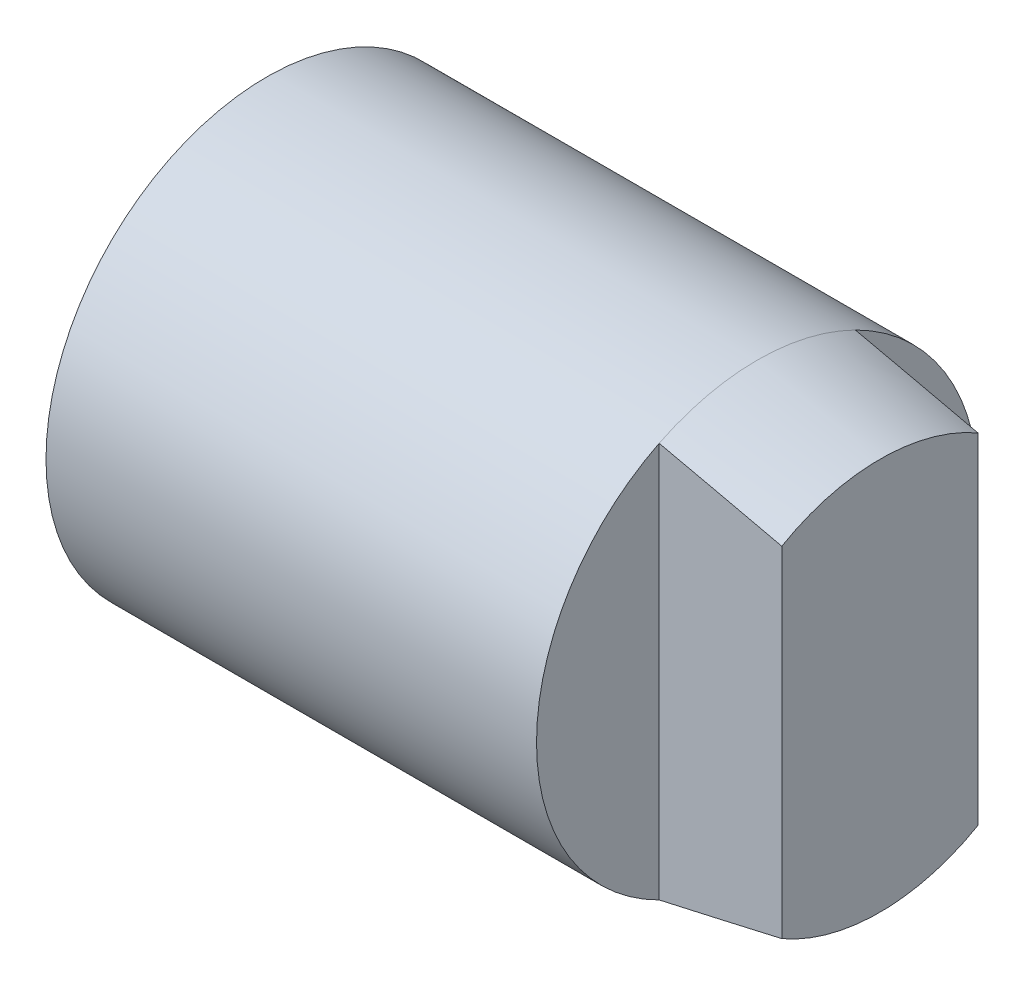
ISO-10303-21;
HEADER;
FILE_DESCRIPTION(('STEP AP214'),'2;1');
FILE_NAME('part.step','',(''),(''),'','','');
FILE_SCHEMA(('AUTOMOTIVE_DESIGN { 1 0 10303 214 1 1 1 1 }'));
ENDSEC;
DATA;
#1=APPLICATION_CONTEXT('core data for automotive mechanical design processes');
#2=APPLICATION_PROTOCOL_DEFINITION('international standard','automotive_design',2000,#1);
#3=PRODUCT_CONTEXT('',#1,'mechanical');
#4=PRODUCT('Part','Part','',(#3));
#5=PRODUCT_RELATED_PRODUCT_CATEGORY('part','',(#4));
#6=PRODUCT_DEFINITION_FORMATION('','',#4);
#7=PRODUCT_DEFINITION_CONTEXT('part definition',#1,'design');
#8=PRODUCT_DEFINITION('design','',#6,#7);
#9=PRODUCT_DEFINITION_SHAPE('','',#8);
#10=(LENGTH_UNIT() NAMED_UNIT(*) SI_UNIT(.MILLI.,.METRE.));
#11=(NAMED_UNIT(*) PLANE_ANGLE_UNIT() SI_UNIT($,.RADIAN.));
#12=(NAMED_UNIT(*) SI_UNIT($,.STERADIAN.) SOLID_ANGLE_UNIT());
#13=UNCERTAINTY_MEASURE_WITH_UNIT(LENGTH_MEASURE(1.E-05),#10,'distance_accuracy_value','');
#14=(GEOMETRIC_REPRESENTATION_CONTEXT(3) GLOBAL_UNCERTAINTY_ASSIGNED_CONTEXT((#13)) GLOBAL_UNIT_ASSIGNED_CONTEXT((#10,
#11,#12)) REPRESENTATION_CONTEXT('',''));
#15=CARTESIAN_POINT('',(0.,0.,0.));
#16=DIRECTION('',(0.,0.,1.));
#17=DIRECTION('',(1.,0.,0.));
#18=AXIS2_PLACEMENT_3D('',#15,#16,#17);
#19=CARTESIAN_POINT('',(12.5,0.,0.));
#20=DIRECTION('',(-1.,0.,0.));
#21=DIRECTION('',(0.,0.,1.));
#22=AXIS2_PLACEMENT_3D('',#19,#20,#21);
#23=CONICAL_SURFACE('',#22,4.,0.197395559849881);
#24=CARTESIAN_POINT('',(12.5,0.,0.));
#25=DIRECTION('',(-1.,0.,0.));
#26=DIRECTION('',(0.,0.,1.));
#27=AXIS2_PLACEMENT_3D('',#24,#25,#26);
#28=CIRCLE('',#27,4.);
#29=CARTESIAN_POINT('',(12.5,-3.46410161513775,-2.));
#30=VERTEX_POINT('',#29);
#31=CARTESIAN_POINT('',(12.5,-3.46410161513775,2.));
#32=VERTEX_POINT('',#31);
#33=EDGE_CURVE('E106',#30,#32,#28,.T.);
#34=ORIENTED_EDGE('',*,*,#33,.T.);
#35=CARTESIAN_POINT('',(20.9411715080671,-1.15942254775247,2.));
#36=CARTESIAN_POINT('',(20.8660016724411,-1.18938638592322,2.));
#37=CARTESIAN_POINT('',(20.790546172661,-1.21862022618851,2.));
#38=CARTESIAN_POINT('',(20.6391697872945,-1.27583995530349,2.));
#39=CARTESIAN_POINT('',(20.5632489400089,-1.30382594533054,2.));
#40=CARTESIAN_POINT('',(20.3349716714176,-1.38622180196954,2.));
#41=CARTESIAN_POINT('',(20.1820581365704,-1.43908616508855,2.));
#42=CARTESIAN_POINT('',(19.8753352179094,-1.5417434276278,2.));
#43=CARTESIAN_POINT('',(19.7215265573275,-1.59153850827934,2.));
#44=CARTESIAN_POINT('',(19.4131611090728,-1.68879307307252,2.));
#45=CARTESIAN_POINT('',(19.258604260008,-1.73625236185878,2.));
#46=CARTESIAN_POINT('',(18.7943481885781,-1.87580705564526,2.));
#47=CARTESIAN_POINT('',(18.4838252693263,-1.96515707542199,2.));
#48=CARTESIAN_POINT('',(17.8613557841292,-2.1389805851424,2.));
#49=CARTESIAN_POINT('',(17.5494089037841,-2.22345293574132,2.));
#50=CARTESIAN_POINT('',(16.9136687754089,-2.39175546676185,2.));
#51=CARTESIAN_POINT('',(16.5898423861397,-2.47546012179894,2.));
#52=CARTESIAN_POINT('',(15.941476384565,-2.64006628687885,2.));
#53=CARTESIAN_POINT('',(15.6169367628356,-2.72096775964292,2.));
#54=CARTESIAN_POINT('',(14.9673147337329,-2.88061681991976,2.));
#55=CARTESIAN_POINT('',(14.6422323040677,-2.95936431654369,2.));
#56=CARTESIAN_POINT('',(13.9916583109131,-3.1151526579043,2.));
#57=CARTESIAN_POINT('',(13.666166745898,-3.19219349625689,2.));
#58=CARTESIAN_POINT('',(12.6891675764667,-3.42128042925369,2.));
#59=CARTESIAN_POINT('',(12.0371803474347,-3.57128002828283,2.));
#60=CARTESIAN_POINT('',(10.7323843182456,-3.86756307761905,2.));
#61=CARTESIAN_POINT('',(10.0795755402218,-4.01384662588173,2.));
#62=CARTESIAN_POINT('',(8.77156604727338,-4.30412700552264,2.));
#63=CARTESIAN_POINT('',(8.11636369259255,-4.44811643905647,2.));
#64=CARTESIAN_POINT('',(6.80551386406938,-4.73408013404253,2.));
#65=CARTESIAN_POINT('',(6.14986638625635,-4.87605437726412,2.));
#66=CARTESIAN_POINT('',(4.83846400668146,-5.15840715007355,2.));
#67=CARTESIAN_POINT('',(4.18270921924132,-5.29878621119898,2.));
#68=CARTESIAN_POINT('',(2.87094480579042,-5.57830717351688,2.));
#69=CARTESIAN_POINT('',(2.21493518319291,-5.71744909072119,2.));
#70=CARTESIAN_POINT('',(1.55882849193293,-5.85612873591973,2.));
#71=B_SPLINE_CURVE_WITH_KNOTS('',3,(#35,#36,#37,#38,#39,#40,#41,#42,#43,#44,#45,#46,#47,#48,#49,
#50,#51,#52,#53,#54,#55,#56,#57,#58,#59,#60,#61,#62,#63,#64,#65,#66,#67,#68,#69,#70),
.UNSPECIFIED.,.F.,.F.,(4,2,2,2,2,2,2,2,2,2,2,2,2,2,2,2,2,4),(0.,0.242754141340651,
0.485488563925896,0.97082088746416,1.45580422826551,1.94082806225477,2.91012429587326,
3.87964603309553,4.88303749845384,5.88644230252268,6.88988938099956,7.89334021244289,
9.90038034572051,11.9073675181258,13.9198759201632,15.9324025169733,17.9442375935212,
19.9560465937038),.UNSPECIFIED.);
#72=CARTESIAN_POINT('',(10.,-4.03112887414928,2.));
#73=VERTEX_POINT('',#72);
#74=EDGE_CURVE('E11',#32,#73,#71,.T.);
#75=ORIENTED_EDGE('',*,*,#74,.T.);
#76=CARTESIAN_POINT('',(10.,0.,0.));
#77=DIRECTION('',(-1.,0.,0.));
#78=DIRECTION('',(0.,0.,1.));
#79=AXIS2_PLACEMENT_3D('',#76,#77,#78);
#80=CIRCLE('',#79,4.5);
#81=CARTESIAN_POINT('',(10.,-4.03112887414928,-2.));
#82=VERTEX_POINT('',#81);
#83=EDGE_CURVE('E98',#82,#73,#80,.T.);
#84=ORIENTED_EDGE('',*,*,#83,.F.);
#85=CARTESIAN_POINT('',(1.55882849193293,-5.85612873591973,-2.));
#86=CARTESIAN_POINT('',(1.98081306098831,-5.76694426998963,-2.));
#87=CARTESIAN_POINT('',(2.40275516963324,-5.6775590309681,-2.));
#88=CARTESIAN_POINT('',(3.24653998410319,-5.49831885983609,-2.));
#89=CARTESIAN_POINT('',(3.6683826898412,-5.4084639273161,-2.));
#90=CARTESIAN_POINT('',(4.93364106439664,-5.13811350229078,-2.));
#91=CARTESIAN_POINT('',(5.77688485514883,-4.95681173210658,-2.));
#92=CARTESIAN_POINT('',(7.46220174298452,-4.59136538446255,-2.));
#93=CARTESIAN_POINT('',(8.30427524277354,-4.4072226657726,-2.));
#94=CARTESIAN_POINT('',(9.98759255710945,-4.03469563290561,-2.));
#95=CARTESIAN_POINT('',(10.8288362620095,-3.84631082070706,-2.));
#96=CARTESIAN_POINT('',(12.0594442305662,-3.56573208510107,-2.));
#97=CARTESIAN_POINT('',(12.4493895583219,-3.47608803083638,-2.));
#98=CARTESIAN_POINT('',(13.2288601297159,-3.29502723295478,-2.));
#99=CARTESIAN_POINT('',(13.6183853825141,-3.20361052885197,-2.));
#100=CARTESIAN_POINT('',(14.3967827845945,-3.01853632162998,-2.));
#101=CARTESIAN_POINT('',(14.7856550924373,-2.92487948638373,-2.));
#102=CARTESIAN_POINT('',(15.562704196661,-2.73457703883739,-2.));
#103=CARTESIAN_POINT('',(15.9508809353758,-2.63793118985499,-2.));
#104=CARTESIAN_POINT('',(16.5325555109361,-2.48983872490716,-2.));
#105=CARTESIAN_POINT('',(16.7264444857504,-2.43992846298565,-2.));
#106=CARTESIAN_POINT('',(17.1138993661821,-2.33887545134378,-2.));
#107=CARTESIAN_POINT('',(17.3074652752797,-2.28773271499295,-2.));
#108=CARTESIAN_POINT('',(17.6941543191043,-2.18396864784065,-2.));
#109=CARTESIAN_POINT('',(17.8872775438381,-2.13134765308022,-2.));
#110=CARTESIAN_POINT('',(18.2730235396501,-2.02426654339214,-2.));
#111=CARTESIAN_POINT('',(18.465646289998,-1.96980635355019,-2.));
#112=CARTESIAN_POINT('',(18.8504313204654,-1.85850689930447,-2.));
#113=CARTESIAN_POINT('',(19.0425928747724,-1.80166511915304,-2.));
#114=CARTESIAN_POINT('',(19.4259848457997,-1.68497434093597,-2.));
#115=CARTESIAN_POINT('',(19.6172153646087,-1.62512568111184,-2.));
#116=CARTESIAN_POINT('',(19.9031411850902,-1.53226129828794,-2.));
#117=CARTESIAN_POINT('',(19.998334149301,-1.50077813225522,-2.));
#118=CARTESIAN_POINT('',(20.1883035139065,-1.43658769830577,-2.));
#119=CARTESIAN_POINT('',(20.2830799292905,-1.40388047484599,-2.));
#120=CARTESIAN_POINT('',(20.4721519957212,-1.3369863889372,-2.));
#121=CARTESIAN_POINT('',(20.5664474537764,-1.30279897786615,-2.));
#122=CARTESIAN_POINT('',(20.7543623680099,-1.23258302395656,-2.));
#123=CARTESIAN_POINT('',(20.8479817383567,-1.19655425188311,-2.));
#124=CARTESIAN_POINT('',(20.9411715080671,-1.15942254775247,-2.));
#125=B_SPLINE_CURVE_WITH_KNOTS('',3,(#85,#86,#87,#88,#89,#90,#91,#92,#93,#94,#95,#96,#97,#98,
#99,#100,#101,#102,#103,#104,#105,#106,#107,#108,#109,#110,#111,#112,#113,#114,#115,#116,#117,
#118,#119,#120,#121,#122,#123,#124),.UNSPECIFIED.,.F.,.F.,(4,2,2,2,2,2,2,2,2,2,2,2,2,2,2,2,2,2,
2,4),(0.,1.29391778443653,2.5878366971747,5.17537446468834,7.76128558629634,10.3475018930091,
11.5478491260678,12.7481696329053,13.9481366301643,15.1481988902183,15.7488252031734,
16.3494450036309,16.9499293573714,17.5504381996725,18.1515982125685,18.7526907522035,
19.0534764172858,19.3542511686148,19.6551383708441,19.956063122833),.UNSPECIFIED.);
#126=EDGE_CURVE('E124',#82,#30,#125,.T.);
#127=ORIENTED_EDGE('',*,*,#126,.T.);
#128=EDGE_LOOP('',(#34,#75,#84,#127));
#129=FACE_BOUND('',#128,.T.);
#130=ADVANCED_FACE('F38',(#129),#23,.T.);
#131=CARTESIAN_POINT('',(0.,0.,0.));
#132=DIRECTION('',(-1.,0.,0.));
#133=DIRECTION('',(0.,0.,1.));
#134=AXIS2_PLACEMENT_3D('',#131,#132,#133);
#135=CYLINDRICAL_SURFACE('',#134,4.5);
#136=CARTESIAN_POINT('',(0.,0.,0.));
#137=DIRECTION('',(-1.,0.,0.));
#138=DIRECTION('',(0.,0.,1.));
#139=AXIS2_PLACEMENT_3D('',#136,#137,#138);
#140=CIRCLE('',#139,4.5);
#141=CARTESIAN_POINT('',(0.,0.,4.5));
#142=VERTEX_POINT('',#141);
#143=EDGE_CURVE('E120',#142,#142,#140,.T.);
#144=ORIENTED_EDGE('',*,*,#143,.F.);
#145=EDGE_LOOP('',(#144));
#146=FACE_BOUND('',#145,.T.);
#147=CARTESIAN_POINT('',(10.,4.03112887414928,2.));
#148=VERTEX_POINT('',#147);
#149=CARTESIAN_POINT('',(10.,4.03112887414928,-2.));
#150=VERTEX_POINT('',#149);
#151=EDGE_CURVE('E109',#148,#150,#80,.T.);
#152=ORIENTED_EDGE('',*,*,#151,.T.);
#153=CARTESIAN_POINT('',(10.,0.,0.));
#154=DIRECTION('',(1.,0.,0.));
#155=DIRECTION('',(0.,0.,-1.));
#156=AXIS2_PLACEMENT_3D('',#153,#154,#155);
#157=CIRCLE('',#156,4.5);
#158=EDGE_CURVE('E107',#82,#150,#157,.T.);
#159=ORIENTED_EDGE('',*,*,#158,.F.);
#160=ORIENTED_EDGE('',*,*,#83,.T.);
#161=CARTESIAN_POINT('',(10.,0.,0.));
#162=DIRECTION('',(1.,0.,0.));
#163=DIRECTION('',(0.,0.,-1.));
#164=AXIS2_PLACEMENT_3D('',#161,#162,#163);
#165=CIRCLE('',#164,4.5);
#166=EDGE_CURVE('E84',#148,#73,#165,.T.);
#167=ORIENTED_EDGE('',*,*,#166,.F.);
#168=EDGE_LOOP('',(#152,#159,#160,#167));
#169=FACE_BOUND('',#168,.T.);
#170=ADVANCED_FACE('F40',(#146,#169),#135,.T.);
#171=CARTESIAN_POINT('',(0.,0.,-4.5));
#172=DIRECTION('',(1.,0.,0.));
#173=DIRECTION('',(0.,0.,-1.));
#174=AXIS2_PLACEMENT_3D('',#171,#172,#173);
#175=PLANE('',#174);
#176=ORIENTED_EDGE('',*,*,#143,.T.);
#177=EDGE_LOOP('',(#176));
#178=FACE_BOUND('',#177,.T.);
#179=ADVANCED_FACE('F172',(#178),#175,.F.);
#180=CARTESIAN_POINT('',(12.5,0.,0.));
#181=DIRECTION('',(-1.,0.,0.));
#182=DIRECTION('',(0.,0.,1.));
#183=AXIS2_PLACEMENT_3D('',#180,#181,#182);
#184=PLANE('',#183);
#185=CARTESIAN_POINT('',(12.5,3.46410161513775,2.));
#186=VERTEX_POINT('',#185);
#187=CARTESIAN_POINT('',(12.5,3.46410161513775,-2.));
#188=VERTEX_POINT('',#187);
#189=EDGE_CURVE('E116',#186,#188,#28,.T.);
#190=ORIENTED_EDGE('',*,*,#189,.F.);
#191=DIRECTION('',(0.,1.,0.));
#192=VECTOR('',#191,1.);
#193=CARTESIAN_POINT('',(12.5,-4.03112887414928,2.));
#194=LINE('',#193,#192);
#195=EDGE_CURVE('E91',#32,#186,#194,.T.);
#196=ORIENTED_EDGE('',*,*,#195,.F.);
#197=ORIENTED_EDGE('',*,*,#33,.F.);
#198=DIRECTION('',(0.,-1.,0.));
#199=VECTOR('',#198,1.);
#200=CARTESIAN_POINT('',(12.5,-4.03112887414928,-2.));
#201=LINE('',#200,#199);
#202=EDGE_CURVE('E114',#188,#30,#201,.T.);
#203=ORIENTED_EDGE('',*,*,#202,.F.);
#204=EDGE_LOOP('',(#190,#196,#197,#203));
#205=FACE_BOUND('',#204,.T.);
#206=ADVANCED_FACE('F163',(#205),#184,.F.);
#207=ORIENTED_EDGE('',*,*,#151,.F.);
#208=CARTESIAN_POINT('',(1.55882849193293,5.85612873591973,2.));
#209=CARTESIAN_POINT('',(1.98081306098831,5.76694426998963,2.));
#210=CARTESIAN_POINT('',(2.40275516963324,5.6775590309681,2.));
#211=CARTESIAN_POINT('',(3.24653998410319,5.49831885983609,2.));
#212=CARTESIAN_POINT('',(3.6683826898412,5.4084639273161,2.));
#213=CARTESIAN_POINT('',(4.93364106439664,5.13811350229078,2.));
#214=CARTESIAN_POINT('',(5.77688485514883,4.95681173210658,2.));
#215=CARTESIAN_POINT('',(7.46220174298452,4.59136538446255,2.));
#216=CARTESIAN_POINT('',(8.30427524277354,4.4072226657726,2.));
#217=CARTESIAN_POINT('',(9.98759255710945,4.03469563290561,2.));
#218=CARTESIAN_POINT('',(10.8288362620095,3.84631082070706,2.));
#219=CARTESIAN_POINT('',(12.0594442305662,3.56573208510109,2.));
#220=CARTESIAN_POINT('',(12.4493895583218,3.47608803083641,2.));
#221=CARTESIAN_POINT('',(13.2288601297156,3.29502723295484,2.));
#222=CARTESIAN_POINT('',(13.6183853825138,3.20361052885205,2.));
#223=CARTESIAN_POINT('',(14.396782784594,3.01853632163008,2.));
#224=CARTESIAN_POINT('',(14.7856550924368,2.92487948638385,2.));
#225=CARTESIAN_POINT('',(15.5627041966603,2.73457703883755,2.));
#226=CARTESIAN_POINT('',(15.9508809353751,2.63793118985517,2.));
#227=CARTESIAN_POINT('',(16.5325555109353,2.48983872490736,2.));
#228=CARTESIAN_POINT('',(16.7264444857496,2.43992846298586,2.));
#229=CARTESIAN_POINT('',(17.1138993661812,2.33887545134401,2.));
#230=CARTESIAN_POINT('',(17.3074652752788,2.28773271499319,2.));
#231=CARTESIAN_POINT('',(17.6941543191033,2.18396864784091,2.));
#232=CARTESIAN_POINT('',(17.887277543837,2.1313476530805,2.));
#233=CARTESIAN_POINT('',(18.273023539649,2.02426654339244,2.));
#234=CARTESIAN_POINT('',(18.4656462899969,1.96980635355051,2.));
#235=CARTESIAN_POINT('',(18.8504313204642,1.85850689930481,2.));
#236=CARTESIAN_POINT('',(19.0425928747712,1.80166511915339,2.));
#237=CARTESIAN_POINT('',(19.4259848457984,1.68497434093636,2.));
#238=CARTESIAN_POINT('',(19.6172153646074,1.62512568111224,2.));
#239=CARTESIAN_POINT('',(19.9031411850889,1.53226129828837,2.));
#240=CARTESIAN_POINT('',(19.9983341492997,1.50077813225567,2.));
#241=CARTESIAN_POINT('',(20.1883035139051,1.43658769830624,2.));
#242=CARTESIAN_POINT('',(20.2830799292891,1.40388047484647,2.));
#243=CARTESIAN_POINT('',(20.4721519957198,1.3369863889377,2.));
#244=CARTESIAN_POINT('',(20.566447453775,1.30279897786667,2.));
#245=CARTESIAN_POINT('',(20.7543623680084,1.23258302395711,2.));
#246=CARTESIAN_POINT('',(20.8479817383553,1.19655425188367,2.));
#247=CARTESIAN_POINT('',(20.9411715080656,1.15942254775305,2.));
#248=B_SPLINE_CURVE_WITH_KNOTS('',3,(#208,#209,#210,#211,#212,#213,#214,#215,#216,#217,#218,
#219,#220,#221,#222,#223,#224,#225,#226,#227,#228,#229,#230,#231,#232,#233,#234,#235,#236,#237,
#238,#239,#240,#241,#242,#243,#244,#245,#246,#247),.UNSPECIFIED.,.F.,.F.,(4,2,2,2,2,2,2,2,2,2,2,
2,2,2,2,2,2,2,2,4),(0.,1.29391778443653,2.5878366971747,5.17537446468834,7.76128558629634,
10.3475018930091,11.5478491260676,12.7481696329049,13.9481366301637,15.1481988902175,
15.7488252031725,16.3494450036299,16.9499293573703,17.5504381996713,18.1515982125672,
18.7526907522021,19.0534764172844,19.3542511686133,19.6551383708426,19.9560631228314),.UNSPECIFIED.);
#249=EDGE_CURVE('E53',#148,#186,#248,.T.);
#250=ORIENTED_EDGE('',*,*,#249,.T.);
#251=ORIENTED_EDGE('',*,*,#189,.T.);
#252=CARTESIAN_POINT('',(20.9411715080656,1.15942254775305,-2.));
#253=CARTESIAN_POINT('',(20.8660016724396,1.1893863859238,-2.));
#254=CARTESIAN_POINT('',(20.7905461726595,1.21862022618909,-2.));
#255=CARTESIAN_POINT('',(20.639169787293,1.27583995530405,-2.));
#256=CARTESIAN_POINT('',(20.5632489400074,1.3038259453311,-2.));
#257=CARTESIAN_POINT('',(20.3349716714161,1.38622180197009,-2.));
#258=CARTESIAN_POINT('',(20.1820581365688,1.4390861650891,-2.));
#259=CARTESIAN_POINT('',(19.8753352179078,1.54174342762834,-2.));
#260=CARTESIAN_POINT('',(19.7215265573259,1.59153850827988,-2.));
#261=CARTESIAN_POINT('',(19.4131611090711,1.68879307307305,-2.));
#262=CARTESIAN_POINT('',(19.2586042600063,1.73625236185931,-2.));
#263=CARTESIAN_POINT('',(18.7943481885763,1.87580705564578,-2.));
#264=CARTESIAN_POINT('',(18.4838252693245,1.96515707542251,-2.));
#265=CARTESIAN_POINT('',(17.8613557841273,2.13898058514293,-2.));
#266=CARTESIAN_POINT('',(17.5494089037822,2.22345293574184,-2.));
#267=CARTESIAN_POINT('',(16.913668775407,2.39175546676235,-2.));
#268=CARTESIAN_POINT('',(16.5898423861378,2.47546012179943,-2.));
#269=CARTESIAN_POINT('',(15.9414763845632,2.64006628687931,-2.));
#270=CARTESIAN_POINT('',(15.6169367628338,2.72096775964336,-2.));
#271=CARTESIAN_POINT('',(14.9673147337312,2.88061681992018,-2.));
#272=CARTESIAN_POINT('',(14.642232304066,2.95936431654409,-2.));
#273=CARTESIAN_POINT('',(13.9916583109115,3.11515265790468,-2.));
#274=CARTESIAN_POINT('',(13.6661667458965,3.19219349625725,-2.));
#275=CARTESIAN_POINT('',(12.6891675764653,3.42128042925402,-2.));
#276=CARTESIAN_POINT('',(12.0371803474333,3.57128002828314,-2.));
#277=CARTESIAN_POINT('',(10.7323843182445,3.86756307761931,-2.));
#278=CARTESIAN_POINT('',(10.0795755402207,4.01384662588198,-2.));
#279=CARTESIAN_POINT('',(8.77156604727245,4.30412700552284,-2.));
#280=CARTESIAN_POINT('',(8.1163636925917,4.44811643905666,-2.));
#281=CARTESIAN_POINT('',(6.80551386406871,4.73408013404267,-2.));
#282=CARTESIAN_POINT('',(6.14986638625576,4.87605437726425,-2.));
#283=CARTESIAN_POINT('',(4.83846400668104,5.15840715007364,-2.));
#284=CARTESIAN_POINT('',(4.18270921924098,5.29878621119905,-2.));
#285=CARTESIAN_POINT('',(2.87094480579025,5.57830717351691,-2.));
#286=CARTESIAN_POINT('',(2.21493518319283,5.71744909072121,-2.));
#287=CARTESIAN_POINT('',(1.55882849193293,5.85612873591973,-2.));
#288=B_SPLINE_CURVE_WITH_KNOTS('',3,(#252,#253,#254,#255,#256,#257,#258,#259,#260,#261,#262,
#263,#264,#265,#266,#267,#268,#269,#270,#271,#272,#273,#274,#275,#276,#277,#278,#279,#280,#281,
#282,#283,#284,#285,#286,#287),.UNSPECIFIED.,.F.,.F.,(4,2,2,2,2,2,2,2,2,2,2,2,2,2,2,2,2,4),(0.,
0.24275414134068,0.485488563925954,0.970820887464278,1.4558042282657,1.94082806225501,
2.91012429587361,3.87964603309599,4.88303749845418,5.8864423025229,6.88988938099965,
7.89334021244285,9.90038034572023,11.9073675181253,13.9198759201624,15.9324025169722,
17.9442375935199,19.9560465937023),.UNSPECIFIED.);
#289=EDGE_CURVE('E132',#188,#150,#288,.T.);
#290=ORIENTED_EDGE('',*,*,#289,.T.);
#291=EDGE_LOOP('',(#207,#250,#251,#290));
#292=FACE_BOUND('',#291,.T.);
#293=ADVANCED_FACE('F137',(#292),#23,.T.);
#294=CARTESIAN_POINT('',(10.,-4.03112887414928,-2.));
#295=DIRECTION('',(0.,0.,1.));
#296=DIRECTION('',(1.,0.,0.));
#297=AXIS2_PLACEMENT_3D('',#294,#295,#296);
#298=PLANE('',#297);
#299=ORIENTED_EDGE('',*,*,#202,.T.);
#300=ORIENTED_EDGE('',*,*,#126,.F.);
#301=DIRECTION('',(0.,-1.,0.));
#302=VECTOR('',#301,1.);
#303=CARTESIAN_POINT('',(10.,-4.03112887414928,-2.));
#304=LINE('',#303,#302);
#305=EDGE_CURVE('E59',#150,#82,#304,.T.);
#306=ORIENTED_EDGE('',*,*,#305,.F.);
#307=ORIENTED_EDGE('',*,*,#289,.F.);
#308=EDGE_LOOP('',(#299,#300,#306,#307));
#309=FACE_BOUND('',#308,.T.);
#310=ADVANCED_FACE('F140',(#309),#298,.F.);
#311=CARTESIAN_POINT('',(10.,0.,0.));
#312=DIRECTION('',(1.,0.,0.));
#313=DIRECTION('',(0.,0.,-1.));
#314=AXIS2_PLACEMENT_3D('',#311,#312,#313);
#315=PLANE('',#314);
#316=ORIENTED_EDGE('',*,*,#158,.T.);
#317=ORIENTED_EDGE('',*,*,#305,.T.);
#318=EDGE_LOOP('',(#316,#317));
#319=FACE_BOUND('',#318,.T.);
#320=ADVANCED_FACE('F144',(#319),#315,.T.);
#321=CARTESIAN_POINT('',(10.,-4.03112887414928,2.));
#322=DIRECTION('',(0.,0.,-1.));
#323=DIRECTION('',(-1.,0.,0.));
#324=AXIS2_PLACEMENT_3D('',#321,#322,#323);
#325=PLANE('',#324);
#326=ORIENTED_EDGE('',*,*,#195,.T.);
#327=ORIENTED_EDGE('',*,*,#249,.F.);
#328=DIRECTION('',(0.,1.,0.));
#329=VECTOR('',#328,1.);
#330=CARTESIAN_POINT('',(10.,-4.03112887414928,2.));
#331=LINE('',#330,#329);
#332=EDGE_CURVE('E66',#73,#148,#331,.T.);
#333=ORIENTED_EDGE('',*,*,#332,.F.);
#334=ORIENTED_EDGE('',*,*,#74,.F.);
#335=EDGE_LOOP('',(#326,#327,#333,#334));
#336=FACE_BOUND('',#335,.T.);
#337=ADVANCED_FACE('F94',(#336),#325,.F.);
#338=CARTESIAN_POINT('',(10.,0.,0.));
#339=DIRECTION('',(1.,0.,0.));
#340=DIRECTION('',(0.,0.,-1.));
#341=AXIS2_PLACEMENT_3D('',#338,#339,#340);
#342=PLANE('',#341);
#343=ORIENTED_EDGE('',*,*,#166,.T.);
#344=ORIENTED_EDGE('',*,*,#332,.T.);
#345=EDGE_LOOP('',(#343,#344));
#346=FACE_BOUND('',#345,.T.);
#347=ADVANCED_FACE('F85',(#346),#342,.T.);
#348=CLOSED_SHELL('',(#130,#170,#179,#206,#293,#310,#320,#337,#347));
#349=MANIFOLD_SOLID_BREP('B2',#348);
#350=ADVANCED_BREP_SHAPE_REPRESENTATION('',(#18,#349),#14);
#351=SHAPE_DEFINITION_REPRESENTATION(#9,#350);
ENDSEC;
END-ISO-10303-21;
